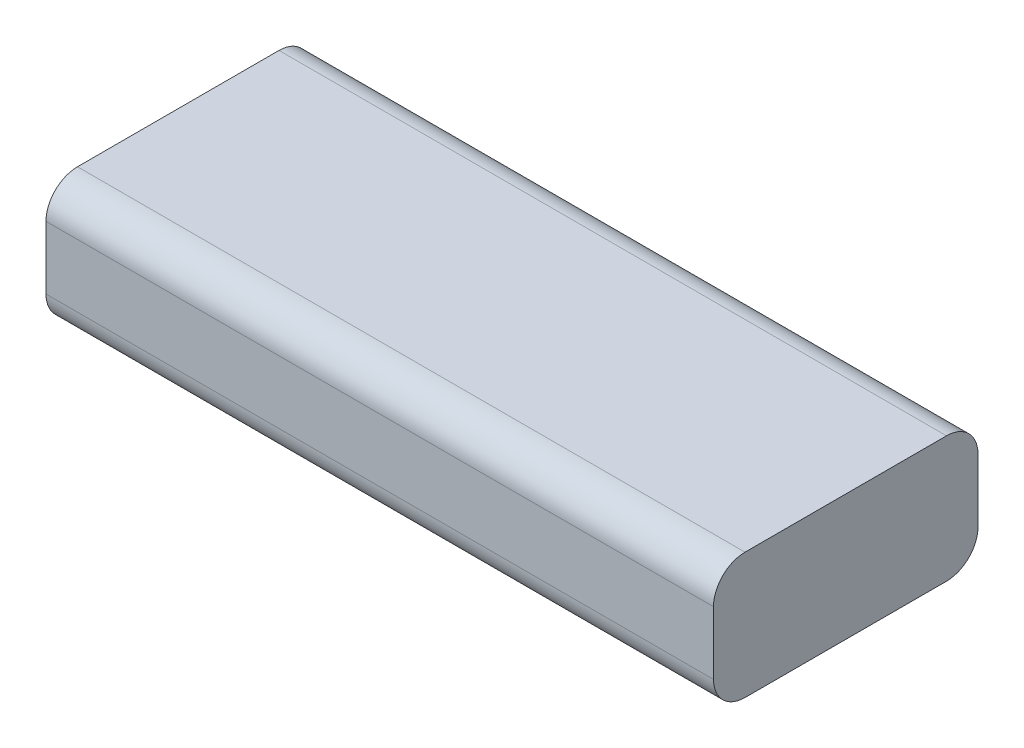
ISO-10303-21;
HEADER;
FILE_DESCRIPTION(('STEP AP214'),'2;1');
FILE_NAME('part.step','',(''),(''),'','','');
FILE_SCHEMA(('AUTOMOTIVE_DESIGN { 1 0 10303 214 1 1 1 1 }'));
ENDSEC;
DATA;
#1=APPLICATION_CONTEXT('core data for automotive mechanical design processes');
#2=APPLICATION_PROTOCOL_DEFINITION('international standard','automotive_design',2000,#1);
#3=PRODUCT_CONTEXT('',#1,'mechanical');
#4=PRODUCT('Part','Part','',(#3));
#5=PRODUCT_RELATED_PRODUCT_CATEGORY('part','',(#4));
#6=PRODUCT_DEFINITION_FORMATION('','',#4);
#7=PRODUCT_DEFINITION_CONTEXT('part definition',#1,'design');
#8=PRODUCT_DEFINITION('design','',#6,#7);
#9=PRODUCT_DEFINITION_SHAPE('','',#8);
#10=(LENGTH_UNIT() NAMED_UNIT(*) SI_UNIT(.MILLI.,.METRE.));
#11=(NAMED_UNIT(*) PLANE_ANGLE_UNIT() SI_UNIT($,.RADIAN.));
#12=(NAMED_UNIT(*) SI_UNIT($,.STERADIAN.) SOLID_ANGLE_UNIT());
#13=UNCERTAINTY_MEASURE_WITH_UNIT(LENGTH_MEASURE(1.E-05),#10,'distance_accuracy_value','');
#14=(GEOMETRIC_REPRESENTATION_CONTEXT(3) GLOBAL_UNCERTAINTY_ASSIGNED_CONTEXT((#13)) GLOBAL_UNIT_ASSIGNED_CONTEXT((#10,
#11,#12)) REPRESENTATION_CONTEXT('',''));
#15=CARTESIAN_POINT('',(0.,0.,0.));
#16=DIRECTION('',(0.,0.,1.));
#17=DIRECTION('',(1.,0.,0.));
#18=AXIS2_PLACEMENT_3D('',#15,#16,#17);
#19=CARTESIAN_POINT('',(0.,20.,0.));
#20=DIRECTION('',(1.,0.,0.));
#21=DIRECTION('',(0.,0.,-1.));
#22=AXIS2_PLACEMENT_3D('',#19,#20,#21);
#23=PLANE('',#22);
#24=DIRECTION('',(0.,-1.,0.));
#25=VECTOR('',#24,1.);
#26=CARTESIAN_POINT('',(0.,20.,-42.));
#27=LINE('',#26,#25);
#28=CARTESIAN_POINT('',(0.,15.,-42.));
#29=VERTEX_POINT('',#28);
#30=CARTESIAN_POINT('',(0.,5.,-42.));
#31=VERTEX_POINT('',#30);
#32=EDGE_CURVE('E103',#29,#31,#27,.T.);
#33=ORIENTED_EDGE('',*,*,#32,.T.);
#34=CARTESIAN_POINT('',(0.,5.,-37.));
#35=DIRECTION('',(1.,0.,0.));
#36=DIRECTION('',(0.,0.,-1.));
#37=AXIS2_PLACEMENT_3D('',#34,#35,#36);
#38=CIRCLE('',#37,5.);
#39=CARTESIAN_POINT('',(0.,0.,-37.));
#40=VERTEX_POINT('',#39);
#41=EDGE_CURVE('E136',#31,#40,#38,.F.);
#42=ORIENTED_EDGE('',*,*,#41,.T.);
#43=DIRECTION('',(0.,0.,1.));
#44=VECTOR('',#43,1.);
#45=CARTESIAN_POINT('',(0.,0.,0.));
#46=LINE('',#45,#44);
#47=CARTESIAN_POINT('',(0.,0.,-5.));
#48=VERTEX_POINT('',#47);
#49=EDGE_CURVE('E163',#40,#48,#46,.T.);
#50=ORIENTED_EDGE('',*,*,#49,.T.);
#51=CARTESIAN_POINT('',(0.,5.,-5.));
#52=DIRECTION('',(1.,0.,0.));
#53=DIRECTION('',(0.,0.,-1.));
#54=AXIS2_PLACEMENT_3D('',#51,#52,#53);
#55=CIRCLE('',#54,5.);
#56=CARTESIAN_POINT('',(0.,5.,0.));
#57=VERTEX_POINT('',#56);
#58=EDGE_CURVE('E109',#48,#57,#55,.F.);
#59=ORIENTED_EDGE('',*,*,#58,.T.);
#60=DIRECTION('',(0.,-1.,0.));
#61=VECTOR('',#60,1.);
#62=CARTESIAN_POINT('',(0.,20.,0.));
#63=LINE('',#62,#61);
#64=CARTESIAN_POINT('',(0.,15.,0.));
#65=VERTEX_POINT('',#64);
#66=EDGE_CURVE('E126',#65,#57,#63,.T.);
#67=ORIENTED_EDGE('',*,*,#66,.F.);
#68=CARTESIAN_POINT('',(0.,15.,-5.));
#69=DIRECTION('',(1.,0.,0.));
#70=DIRECTION('',(0.,0.,-1.));
#71=AXIS2_PLACEMENT_3D('',#68,#69,#70);
#72=CIRCLE('',#71,5.);
#73=CARTESIAN_POINT('',(0.,20.,-5.));
#74=VERTEX_POINT('',#73);
#75=EDGE_CURVE('E110',#65,#74,#72,.F.);
#76=ORIENTED_EDGE('',*,*,#75,.T.);
#77=DIRECTION('',(0.,0.,1.));
#78=VECTOR('',#77,1.);
#79=CARTESIAN_POINT('',(0.,20.,0.));
#80=LINE('',#79,#78);
#81=CARTESIAN_POINT('',(0.,20.,-37.));
#82=VERTEX_POINT('',#81);
#83=EDGE_CURVE('E105',#82,#74,#80,.T.);
#84=ORIENTED_EDGE('',*,*,#83,.F.);
#85=CARTESIAN_POINT('',(0.,15.,-37.));
#86=DIRECTION('',(1.,0.,0.));
#87=DIRECTION('',(0.,0.,-1.));
#88=AXIS2_PLACEMENT_3D('',#85,#86,#87);
#89=CIRCLE('',#88,5.);
#90=EDGE_CURVE('E101',#82,#29,#89,.F.);
#91=ORIENTED_EDGE('',*,*,#90,.T.);
#92=EDGE_LOOP('',(#33,#42,#50,#59,#67,#76,#84,#91));
#93=FACE_BOUND('',#92,.T.);
#94=ADVANCED_FACE('F34',(#93),#23,.F.);
#95=CARTESIAN_POINT('',(0.,20.,0.));
#96=DIRECTION('',(0.,0.,-1.));
#97=DIRECTION('',(-1.,0.,0.));
#98=AXIS2_PLACEMENT_3D('',#95,#96,#97);
#99=PLANE('',#98);
#100=ORIENTED_EDGE('',*,*,#66,.T.);
#101=DIRECTION('',(1.,0.,0.));
#102=VECTOR('',#101,1.);
#103=CARTESIAN_POINT('',(106.,5.,0.));
#104=LINE('',#103,#102);
#105=CARTESIAN_POINT('',(106.,5.,0.));
#106=VERTEX_POINT('',#105);
#107=EDGE_CURVE('E149',#57,#106,#104,.T.);
#108=ORIENTED_EDGE('',*,*,#107,.T.);
#109=DIRECTION('',(0.,-1.,0.));
#110=VECTOR('',#109,1.);
#111=CARTESIAN_POINT('',(106.,20.,0.));
#112=LINE('',#111,#110);
#113=CARTESIAN_POINT('',(106.,15.,0.));
#114=VERTEX_POINT('',#113);
#115=EDGE_CURVE('E130',#114,#106,#112,.T.);
#116=ORIENTED_EDGE('',*,*,#115,.F.);
#117=DIRECTION('',(1.,0.,0.));
#118=VECTOR('',#117,1.);
#119=CARTESIAN_POINT('',(0.,15.,0.));
#120=LINE('',#119,#118);
#121=EDGE_CURVE('E147',#114,#65,#120,.F.);
#122=ORIENTED_EDGE('',*,*,#121,.T.);
#123=EDGE_LOOP('',(#100,#108,#116,#122));
#124=FACE_BOUND('',#123,.T.);
#125=ADVANCED_FACE('F170',(#124),#99,.F.);
#126=CARTESIAN_POINT('',(106.,20.,0.));
#127=DIRECTION('',(-1.,0.,0.));
#128=DIRECTION('',(0.,0.,1.));
#129=AXIS2_PLACEMENT_3D('',#126,#127,#128);
#130=PLANE('',#129);
#131=DIRECTION('',(0.,0.,-1.));
#132=VECTOR('',#131,1.);
#133=CARTESIAN_POINT('',(106.,0.,0.));
#134=LINE('',#133,#132);
#135=CARTESIAN_POINT('',(106.,0.,-5.));
#136=VERTEX_POINT('',#135);
#137=CARTESIAN_POINT('',(106.,0.,-37.));
#138=VERTEX_POINT('',#137);
#139=EDGE_CURVE('E160',#136,#138,#134,.T.);
#140=ORIENTED_EDGE('',*,*,#139,.T.);
#141=CARTESIAN_POINT('',(106.,5.,-37.));
#142=DIRECTION('',(-1.,0.,0.));
#143=DIRECTION('',(0.,0.,1.));
#144=AXIS2_PLACEMENT_3D('',#141,#142,#143);
#145=CIRCLE('',#144,5.);
#146=CARTESIAN_POINT('',(106.,5.,-42.));
#147=VERTEX_POINT('',#146);
#148=EDGE_CURVE('E145',#138,#147,#145,.F.);
#149=ORIENTED_EDGE('',*,*,#148,.T.);
#150=DIRECTION('',(0.,-1.,0.));
#151=VECTOR('',#150,1.);
#152=CARTESIAN_POINT('',(106.,20.,-42.));
#153=LINE('',#152,#151);
#154=CARTESIAN_POINT('',(106.,15.,-42.));
#155=VERTEX_POINT('',#154);
#156=EDGE_CURVE('E120',#155,#147,#153,.T.);
#157=ORIENTED_EDGE('',*,*,#156,.F.);
#158=CARTESIAN_POINT('',(106.,15.,-37.));
#159=DIRECTION('',(-1.,0.,0.));
#160=DIRECTION('',(0.,0.,1.));
#161=AXIS2_PLACEMENT_3D('',#158,#159,#160);
#162=CIRCLE('',#161,5.);
#163=CARTESIAN_POINT('',(106.,20.,-37.));
#164=VERTEX_POINT('',#163);
#165=EDGE_CURVE('E125',#155,#164,#162,.F.);
#166=ORIENTED_EDGE('',*,*,#165,.T.);
#167=DIRECTION('',(0.,0.,-1.));
#168=VECTOR('',#167,1.);
#169=CARTESIAN_POINT('',(106.,20.,0.));
#170=LINE('',#169,#168);
#171=CARTESIAN_POINT('',(106.,20.,-5.));
#172=VERTEX_POINT('',#171);
#173=EDGE_CURVE('E121',#172,#164,#170,.T.);
#174=ORIENTED_EDGE('',*,*,#173,.F.);
#175=CARTESIAN_POINT('',(106.,15.,-5.));
#176=DIRECTION('',(-1.,0.,0.));
#177=DIRECTION('',(0.,0.,1.));
#178=AXIS2_PLACEMENT_3D('',#175,#176,#177);
#179=CIRCLE('',#178,5.);
#180=EDGE_CURVE('E57',#172,#114,#179,.F.);
#181=ORIENTED_EDGE('',*,*,#180,.T.);
#182=ORIENTED_EDGE('',*,*,#115,.T.);
#183=CARTESIAN_POINT('',(106.,5.,-5.));
#184=DIRECTION('',(-1.,0.,0.));
#185=DIRECTION('',(0.,0.,1.));
#186=AXIS2_PLACEMENT_3D('',#183,#184,#185);
#187=CIRCLE('',#186,5.);
#188=EDGE_CURVE('E49',#106,#136,#187,.F.);
#189=ORIENTED_EDGE('',*,*,#188,.T.);
#190=EDGE_LOOP('',(#140,#149,#157,#166,#174,#181,#182,#189));
#191=FACE_BOUND('',#190,.T.);
#192=ADVANCED_FACE('F158',(#191),#130,.F.);
#193=CARTESIAN_POINT('',(0.,20.,-42.));
#194=DIRECTION('',(0.,0.,1.));
#195=DIRECTION('',(1.,0.,0.));
#196=AXIS2_PLACEMENT_3D('',#193,#194,#195);
#197=PLANE('',#196);
#198=ORIENTED_EDGE('',*,*,#156,.T.);
#199=DIRECTION('',(-1.,0.,0.));
#200=VECTOR('',#199,1.);
#201=CARTESIAN_POINT('',(0.,5.,-42.));
#202=LINE('',#201,#200);
#203=EDGE_CURVE('E119',#147,#31,#202,.T.);
#204=ORIENTED_EDGE('',*,*,#203,.T.);
#205=ORIENTED_EDGE('',*,*,#32,.F.);
#206=DIRECTION('',(-1.,0.,0.));
#207=VECTOR('',#206,1.);
#208=CARTESIAN_POINT('',(0.,15.,-42.));
#209=LINE('',#208,#207);
#210=EDGE_CURVE('E116',#29,#155,#209,.F.);
#211=ORIENTED_EDGE('',*,*,#210,.T.);
#212=EDGE_LOOP('',(#198,#204,#205,#211));
#213=FACE_BOUND('',#212,.T.);
#214=ADVANCED_FACE('F115',(#213),#197,.F.);
#215=CARTESIAN_POINT('',(0.,20.,0.));
#216=DIRECTION('',(0.,-1.,0.));
#217=DIRECTION('',(0.,0.,-1.));
#218=AXIS2_PLACEMENT_3D('',#215,#216,#217);
#219=PLANE('',#218);
#220=ORIENTED_EDGE('',*,*,#173,.T.);
#221=DIRECTION('',(-1.,0.,0.));
#222=VECTOR('',#221,1.);
#223=CARTESIAN_POINT('',(0.,20.,-37.));
#224=LINE('',#223,#222);
#225=EDGE_CURVE('E11',#164,#82,#224,.T.);
#226=ORIENTED_EDGE('',*,*,#225,.T.);
#227=ORIENTED_EDGE('',*,*,#83,.T.);
#228=DIRECTION('',(1.,0.,0.));
#229=VECTOR('',#228,1.);
#230=CARTESIAN_POINT('',(0.,20.,-5.));
#231=LINE('',#230,#229);
#232=EDGE_CURVE('E42',#74,#172,#231,.T.);
#233=ORIENTED_EDGE('',*,*,#232,.T.);
#234=EDGE_LOOP('',(#220,#226,#227,#233));
#235=FACE_BOUND('',#234,.T.);
#236=ADVANCED_FACE('F154',(#235),#219,.F.);
#237=CARTESIAN_POINT('',(0.,0.,0.));
#238=DIRECTION('',(0.,-1.,0.));
#239=DIRECTION('',(0.,0.,-1.));
#240=AXIS2_PLACEMENT_3D('',#237,#238,#239);
#241=PLANE('',#240);
#242=ORIENTED_EDGE('',*,*,#49,.F.);
#243=DIRECTION('',(-1.,0.,0.));
#244=VECTOR('',#243,1.);
#245=CARTESIAN_POINT('',(106.,0.,-37.));
#246=LINE('',#245,#244);
#247=EDGE_CURVE('E140',#40,#138,#246,.F.);
#248=ORIENTED_EDGE('',*,*,#247,.T.);
#249=ORIENTED_EDGE('',*,*,#139,.F.);
#250=DIRECTION('',(1.,0.,0.));
#251=VECTOR('',#250,1.);
#252=CARTESIAN_POINT('',(0.,0.,-5.));
#253=LINE('',#252,#251);
#254=EDGE_CURVE('E138',#136,#48,#253,.F.);
#255=ORIENTED_EDGE('',*,*,#254,.T.);
#256=EDGE_LOOP('',(#242,#248,#249,#255));
#257=FACE_BOUND('',#256,.T.);
#258=ADVANCED_FACE('F176',(#257),#241,.T.);
#259=CARTESIAN_POINT('',(0.,5.,-37.));
#260=DIRECTION('',(1.,0.,0.));
#261=DIRECTION('',(0.,0.,-1.));
#262=AXIS2_PLACEMENT_3D('',#259,#260,#261);
#263=CYLINDRICAL_SURFACE('',#262,5.);
#264=ORIENTED_EDGE('',*,*,#148,.F.);
#265=ORIENTED_EDGE('',*,*,#247,.F.);
#266=ORIENTED_EDGE('',*,*,#41,.F.);
#267=ORIENTED_EDGE('',*,*,#203,.F.);
#268=EDGE_LOOP('',(#264,#265,#266,#267));
#269=FACE_BOUND('',#268,.T.);
#270=ADVANCED_FACE('F180',(#269),#263,.T.);
#271=CARTESIAN_POINT('',(0.,5.,-5.));
#272=DIRECTION('',(-1.,0.,0.));
#273=DIRECTION('',(0.,0.,1.));
#274=AXIS2_PLACEMENT_3D('',#271,#272,#273);
#275=CYLINDRICAL_SURFACE('',#274,5.);
#276=ORIENTED_EDGE('',*,*,#58,.F.);
#277=ORIENTED_EDGE('',*,*,#254,.F.);
#278=ORIENTED_EDGE('',*,*,#188,.F.);
#279=ORIENTED_EDGE('',*,*,#107,.F.);
#280=EDGE_LOOP('',(#276,#277,#278,#279));
#281=FACE_BOUND('',#280,.T.);
#282=ADVANCED_FACE('F173',(#281),#275,.T.);
#283=CARTESIAN_POINT('',(0.,15.,-37.));
#284=DIRECTION('',(-1.,0.,0.));
#285=DIRECTION('',(0.,0.,1.));
#286=AXIS2_PLACEMENT_3D('',#283,#284,#285);
#287=CYLINDRICAL_SURFACE('',#286,5.);
#288=ORIENTED_EDGE('',*,*,#165,.F.);
#289=ORIENTED_EDGE('',*,*,#210,.F.);
#290=ORIENTED_EDGE('',*,*,#90,.F.);
#291=ORIENTED_EDGE('',*,*,#225,.F.);
#292=EDGE_LOOP('',(#288,#289,#290,#291));
#293=FACE_BOUND('',#292,.T.);
#294=ADVANCED_FACE('F124',(#293),#287,.T.);
#295=CARTESIAN_POINT('',(0.,15.,-5.));
#296=DIRECTION('',(1.,0.,0.));
#297=DIRECTION('',(0.,0.,-1.));
#298=AXIS2_PLACEMENT_3D('',#295,#296,#297);
#299=CYLINDRICAL_SURFACE('',#298,5.);
#300=ORIENTED_EDGE('',*,*,#75,.F.);
#301=ORIENTED_EDGE('',*,*,#121,.F.);
#302=ORIENTED_EDGE('',*,*,#180,.F.);
#303=ORIENTED_EDGE('',*,*,#232,.F.);
#304=EDGE_LOOP('',(#300,#301,#302,#303));
#305=FACE_BOUND('',#304,.T.);
#306=ADVANCED_FACE('F36',(#305),#299,.T.);
#307=CLOSED_SHELL('',(#94,#125,#192,#214,#236,#258,#270,#282,#294,#306));
#308=MANIFOLD_SOLID_BREP('B2',#307);
#309=ADVANCED_BREP_SHAPE_REPRESENTATION('',(#18,#308),#14);
#310=SHAPE_DEFINITION_REPRESENTATION(#9,#309);
ENDSEC;
END-ISO-10303-21;
